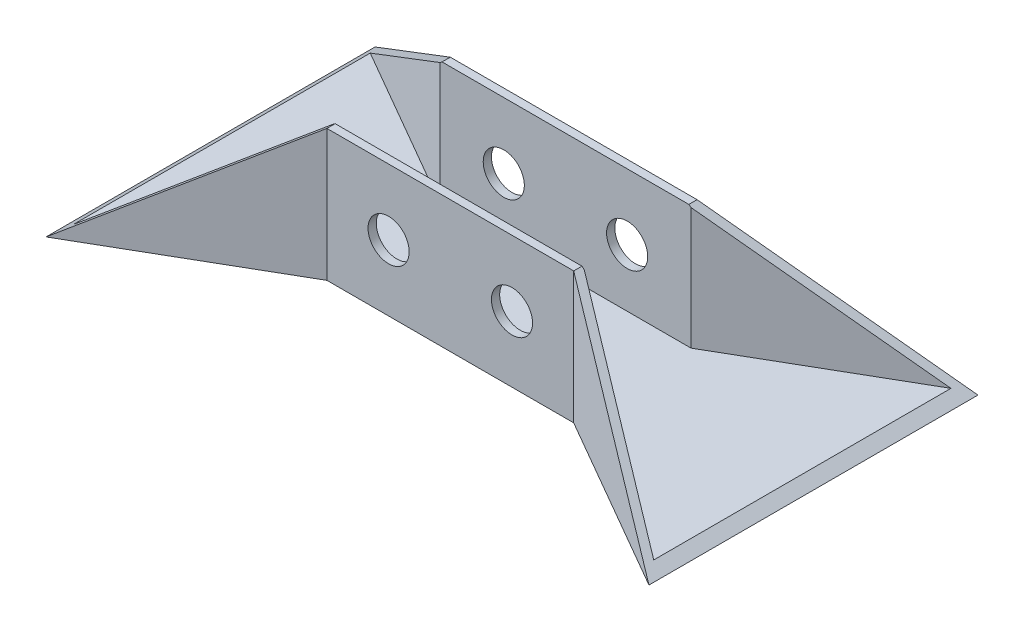
ISO-10303-21;
HEADER;
FILE_DESCRIPTION(('STEP AP214'),'2;1');
FILE_NAME('part.step','',(''),(''),'','','');
FILE_SCHEMA(('AUTOMOTIVE_DESIGN { 1 0 10303 214 1 1 1 1 }'));
ENDSEC;
DATA;
#1=APPLICATION_CONTEXT('core data for automotive mechanical design processes');
#2=APPLICATION_PROTOCOL_DEFINITION('international standard','automotive_design',2000,#1);
#3=PRODUCT_CONTEXT('',#1,'mechanical');
#4=PRODUCT('Part','Part','',(#3));
#5=PRODUCT_RELATED_PRODUCT_CATEGORY('part','',(#4));
#6=PRODUCT_DEFINITION_FORMATION('','',#4);
#7=PRODUCT_DEFINITION_CONTEXT('part definition',#1,'design');
#8=PRODUCT_DEFINITION('design','',#6,#7);
#9=PRODUCT_DEFINITION_SHAPE('','',#8);
#10=(LENGTH_UNIT() NAMED_UNIT(*) SI_UNIT(.MILLI.,.METRE.));
#11=(NAMED_UNIT(*) PLANE_ANGLE_UNIT() SI_UNIT($,.RADIAN.));
#12=(NAMED_UNIT(*) SI_UNIT($,.STERADIAN.) SOLID_ANGLE_UNIT());
#13=UNCERTAINTY_MEASURE_WITH_UNIT(LENGTH_MEASURE(1.E-05),#10,'distance_accuracy_value','');
#14=(GEOMETRIC_REPRESENTATION_CONTEXT(3) GLOBAL_UNCERTAINTY_ASSIGNED_CONTEXT((#13)) GLOBAL_UNIT_ASSIGNED_CONTEXT((#10,
#11,#12)) REPRESENTATION_CONTEXT('',''));
#15=CARTESIAN_POINT('',(0.,0.,0.));
#16=DIRECTION('',(0.,0.,1.));
#17=DIRECTION('',(1.,0.,0.));
#18=AXIS2_PLACEMENT_3D('',#15,#16,#17);
#19=CARTESIAN_POINT('',(0.,5.,0.));
#20=DIRECTION('',(0.,1.,0.));
#21=DIRECTION('',(0.,0.,1.));
#22=AXIS2_PLACEMENT_3D('',#19,#20,#21);
#23=PLANE('',#22);
#24=DIRECTION('',(0.,0.,1.));
#25=VECTOR('',#24,1.);
#26=CARTESIAN_POINT('',(176.487352005989,5.,0.));
#27=LINE('',#26,#25);
#28=CARTESIAN_POINT('',(176.487352005989,5.,-90.3202473081037));
#29=VERTEX_POINT('',#28);
#30=CARTESIAN_POINT('',(176.487352005989,5.,90.3202473081037));
#31=VERTEX_POINT('',#30);
#32=EDGE_CURVE('E218',#29,#31,#27,.T.);
#33=ORIENTED_EDGE('',*,*,#32,.F.);
#34=DIRECTION('',(0.866025403784438,0.,-0.500000000000001));
#35=VECTOR('',#34,1.);
#36=CARTESIAN_POINT('',(76.3397459621556,5.,-32.5));
#37=LINE('',#36,#35);
#38=CARTESIAN_POINT('',(76.3397459621556,5.,-32.5));
#39=VERTEX_POINT('',#38);
#40=EDGE_CURVE('E250',#39,#29,#37,.T.);
#41=ORIENTED_EDGE('',*,*,#40,.F.);
#42=DIRECTION('',(1.,0.,0.));
#43=VECTOR('',#42,1.);
#44=CARTESIAN_POINT('',(-76.3397459621556,5.,-32.5));
#45=LINE('',#44,#43);
#46=CARTESIAN_POINT('',(-76.3397459621556,5.,-32.5));
#47=VERTEX_POINT('',#46);
#48=EDGE_CURVE('E255',#47,#39,#45,.T.);
#49=ORIENTED_EDGE('',*,*,#48,.F.);
#50=DIRECTION('',(0.866025403784438,0.,0.500000000000001));
#51=VECTOR('',#50,1.);
#52=CARTESIAN_POINT('',(-183.253175473055,5.,-94.2264973081037));
#53=LINE('',#52,#51);
#54=CARTESIAN_POINT('',(-176.487352005989,5.,-90.3202473081037));
#55=VERTEX_POINT('',#54);
#56=EDGE_CURVE('E57',#55,#47,#53,.T.);
#57=ORIENTED_EDGE('',*,*,#56,.F.);
#58=DIRECTION('',(0.,0.,-1.));
#59=VECTOR('',#58,1.);
#60=CARTESIAN_POINT('',(-176.487352005989,5.,0.));
#61=LINE('',#60,#59);
#62=CARTESIAN_POINT('',(-176.487352005989,5.,90.3202473081038));
#63=VERTEX_POINT('',#62);
#64=EDGE_CURVE('E232',#63,#55,#61,.T.);
#65=ORIENTED_EDGE('',*,*,#64,.F.);
#66=DIRECTION('',(-0.866025403784438,0.,0.500000000000001));
#67=VECTOR('',#66,1.);
#68=CARTESIAN_POINT('',(-183.253175473055,5.,94.2264973081038));
#69=LINE('',#68,#67);
#70=CARTESIAN_POINT('',(-76.3397459621556,5.,32.5));
#71=VERTEX_POINT('',#70);
#72=EDGE_CURVE('E180',#71,#63,#69,.T.);
#73=ORIENTED_EDGE('',*,*,#72,.F.);
#74=DIRECTION('',(-1.,0.,0.));
#75=VECTOR('',#74,1.);
#76=CARTESIAN_POINT('',(-76.3397459621556,5.,32.5));
#77=LINE('',#76,#75);
#78=CARTESIAN_POINT('',(76.3397459621556,5.,32.5));
#79=VERTEX_POINT('',#78);
#80=EDGE_CURVE('E185',#79,#71,#77,.T.);
#81=ORIENTED_EDGE('',*,*,#80,.F.);
#82=DIRECTION('',(-0.866025403784438,0.,-0.500000000000001));
#83=VECTOR('',#82,1.);
#84=CARTESIAN_POINT('',(76.3397459621556,5.,32.5));
#85=LINE('',#84,#83);
#86=EDGE_CURVE('E184',#31,#79,#85,.T.);
#87=ORIENTED_EDGE('',*,*,#86,.F.);
#88=EDGE_LOOP('',(#33,#41,#49,#57,#65,#73,#81,#87));
#89=FACE_BOUND('',#88,.T.);
#90=ADVANCED_FACE('F32',(#89),#23,.T.);
#91=CARTESIAN_POINT('',(-75.,5.,-37.5));
#92=DIRECTION('',(-0.500000000000001,0.,0.866025403784438));
#93=DIRECTION('',(0.866025403784438,0.,0.500000000000001));
#94=AXIS2_PLACEMENT_3D('',#91,#92,#93);
#95=PLANE('',#94);
#96=DIRECTION('',(-0.866025403784438,0.,-0.500000000000001));
#97=VECTOR('',#96,1.);
#98=CARTESIAN_POINT('',(-75.,0.,-37.5));
#99=LINE('',#98,#97);
#100=CARTESIAN_POINT('',(-75.,0.,-37.5));
#101=VERTEX_POINT('',#100);
#102=CARTESIAN_POINT('',(-183.253175473055,0.,-100.));
#103=VERTEX_POINT('',#102);
#104=EDGE_CURVE('E275',#101,#103,#99,.T.);
#105=ORIENTED_EDGE('',*,*,#104,.T.);
#106=DIRECTION('',(0.729428429853969,0.539053696423368,0.421135700330756));
#107=VECTOR('',#106,1.);
#108=CARTESIAN_POINT('',(-104.490081854181,58.2065834279228,-54.5261066969353));
#109=LINE('',#108,#107);
#110=CARTESIAN_POINT('',(-75.,80.,-37.5));
#111=VERTEX_POINT('',#110);
#112=EDGE_CURVE('E243',#103,#111,#109,.T.);
#113=ORIENTED_EDGE('',*,*,#112,.T.);
#114=DIRECTION('',(0.,-1.,0.));
#115=VECTOR('',#114,1.);
#116=CARTESIAN_POINT('',(-75.,5.,-37.5));
#117=LINE('',#116,#115);
#118=EDGE_CURVE('E168',#111,#101,#117,.T.);
#119=ORIENTED_EDGE('',*,*,#118,.T.);
#120=EDGE_LOOP('',(#105,#113,#119));
#121=FACE_BOUND('',#120,.T.);
#122=ADVANCED_FACE('F34',(#121),#95,.F.);
#123=CARTESIAN_POINT('',(-183.253175473055,5.,100.));
#124=DIRECTION('',(-0.500000000000001,0.,-0.866025403784438));
#125=DIRECTION('',(-0.866025403784438,0.,0.500000000000001));
#126=AXIS2_PLACEMENT_3D('',#123,#124,#125);
#127=PLANE('',#126);
#128=DIRECTION('',(0.,-1.,0.));
#129=VECTOR('',#128,1.);
#130=CARTESIAN_POINT('',(-75.,5.,37.5));
#131=LINE('',#130,#129);
#132=CARTESIAN_POINT('',(-75.,80.,37.5));
#133=VERTEX_POINT('',#132);
#134=CARTESIAN_POINT('',(-75.,0.,37.5));
#135=VERTEX_POINT('',#134);
#136=EDGE_CURVE('E175',#133,#135,#131,.T.);
#137=ORIENTED_EDGE('',*,*,#136,.F.);
#138=DIRECTION('',(-0.729428429853969,-0.539053696423368,0.421135700330756));
#139=VECTOR('',#138,1.);
#140=CARTESIAN_POINT('',(-181.287170016109,1.45289443813848,98.8649262202043));
#141=LINE('',#140,#139);
#142=CARTESIAN_POINT('',(-183.253175473055,0.,100.));
#143=VERTEX_POINT('',#142);
#144=EDGE_CURVE('E240',#133,#143,#141,.T.);
#145=ORIENTED_EDGE('',*,*,#144,.T.);
#146=DIRECTION('',(0.866025403784438,0.,-0.500000000000001));
#147=VECTOR('',#146,1.);
#148=CARTESIAN_POINT('',(-183.253175473055,0.,100.));
#149=LINE('',#148,#147);
#150=EDGE_CURVE('E280',#143,#135,#149,.T.);
#151=ORIENTED_EDGE('',*,*,#150,.T.);
#152=EDGE_LOOP('',(#137,#145,#151));
#153=FACE_BOUND('',#152,.T.);
#154=ADVANCED_FACE('F288',(#153),#127,.F.);
#155=CARTESIAN_POINT('',(-75.,5.,37.5));
#156=DIRECTION('',(0.,0.,-1.));
#157=DIRECTION('',(-1.,0.,0.));
#158=AXIS2_PLACEMENT_3D('',#155,#156,#157);
#159=PLANE('',#158);
#160=CARTESIAN_POINT('',(37.5,40.,37.5));
#161=DIRECTION('',(0.,0.,-1.));
#162=DIRECTION('',(-1.,0.,0.));
#163=AXIS2_PLACEMENT_3D('',#160,#161,#162);
#164=CIRCLE('',#163,12.5);
#165=CARTESIAN_POINT('',(25.,40.,37.5));
#166=VERTEX_POINT('',#165);
#167=EDGE_CURVE('E190',#166,#166,#164,.T.);
#168=ORIENTED_EDGE('',*,*,#167,.T.);
#169=EDGE_LOOP('',(#168));
#170=FACE_BOUND('',#169,.T.);
#171=CARTESIAN_POINT('',(-37.5,40.,37.5));
#172=DIRECTION('',(0.,0.,-1.));
#173=DIRECTION('',(-1.,0.,0.));
#174=AXIS2_PLACEMENT_3D('',#171,#172,#173);
#175=CIRCLE('',#174,12.5);
#176=CARTESIAN_POINT('',(-50.,40.,37.5));
#177=VERTEX_POINT('',#176);
#178=EDGE_CURVE('E208',#177,#177,#175,.T.);
#179=ORIENTED_EDGE('',*,*,#178,.T.);
#180=EDGE_LOOP('',(#179));
#181=FACE_BOUND('',#180,.T.);
#182=DIRECTION('',(1.,0.,0.));
#183=VECTOR('',#182,1.);
#184=CARTESIAN_POINT('',(-75.,0.,37.5));
#185=LINE('',#184,#183);
#186=CARTESIAN_POINT('',(75.,0.,37.5));
#187=VERTEX_POINT('',#186);
#188=EDGE_CURVE('E155',#135,#187,#185,.T.);
#189=ORIENTED_EDGE('',*,*,#188,.T.);
#190=DIRECTION('',(0.,-1.,0.));
#191=VECTOR('',#190,1.);
#192=CARTESIAN_POINT('',(75.,5.,37.5));
#193=LINE('',#192,#191);
#194=CARTESIAN_POINT('',(75.,80.,37.5));
#195=VERTEX_POINT('',#194);
#196=EDGE_CURVE('E152',#195,#187,#193,.T.);
#197=ORIENTED_EDGE('',*,*,#196,.F.);
#198=DIRECTION('',(1.,0.,0.));
#199=VECTOR('',#198,1.);
#200=CARTESIAN_POINT('',(-75.,80.,37.5));
#201=LINE('',#200,#199);
#202=EDGE_CURVE('E262',#133,#195,#201,.T.);
#203=ORIENTED_EDGE('',*,*,#202,.F.);
#204=ORIENTED_EDGE('',*,*,#136,.T.);
#205=EDGE_LOOP('',(#189,#197,#203,#204));
#206=FACE_BOUND('',#205,.T.);
#207=ADVANCED_FACE('F282',(#170,#181,#206),#159,.F.);
#208=CARTESIAN_POINT('',(75.,5.,37.5));
#209=DIRECTION('',(0.500000000000001,0.,-0.866025403784438));
#210=DIRECTION('',(-0.866025403784438,0.,-0.500000000000001));
#211=AXIS2_PLACEMENT_3D('',#208,#209,#210);
#212=PLANE('',#211);
#213=DIRECTION('',(0.866025403784438,0.,0.500000000000001));
#214=VECTOR('',#213,1.);
#215=CARTESIAN_POINT('',(75.,0.,37.5));
#216=LINE('',#215,#214);
#217=CARTESIAN_POINT('',(183.253175473055,0.,100.));
#218=VERTEX_POINT('',#217);
#219=EDGE_CURVE('E150',#187,#218,#216,.T.);
#220=ORIENTED_EDGE('',*,*,#219,.T.);
#221=DIRECTION('',(-0.729428429853969,0.539053696423368,-0.421135700330756));
#222=VECTOR('',#221,1.);
#223=CARTESIAN_POINT('',(104.490081854181,58.2065834279228,54.5261066969353));
#224=LINE('',#223,#222);
#225=EDGE_CURVE('E135',#218,#195,#224,.T.);
#226=ORIENTED_EDGE('',*,*,#225,.T.);
#227=ORIENTED_EDGE('',*,*,#196,.T.);
#228=EDGE_LOOP('',(#220,#226,#227));
#229=FACE_BOUND('',#228,.T.);
#230=ADVANCED_FACE('F151',(#229),#212,.F.);
#231=CARTESIAN_POINT('',(183.253175473055,5.,-100.));
#232=DIRECTION('',(0.500000000000001,0.,0.866025403784438));
#233=DIRECTION('',(0.866025403784438,0.,-0.500000000000001));
#234=AXIS2_PLACEMENT_3D('',#231,#232,#233);
#235=PLANE('',#234);
#236=DIRECTION('',(0.,-1.,0.));
#237=VECTOR('',#236,1.);
#238=CARTESIAN_POINT('',(75.,5.,-37.5));
#239=LINE('',#238,#237);
#240=CARTESIAN_POINT('',(75.,80.,-37.5));
#241=VERTEX_POINT('',#240);
#242=CARTESIAN_POINT('',(75.,0.,-37.5));
#243=VERTEX_POINT('',#242);
#244=EDGE_CURVE('E171',#241,#243,#239,.T.);
#245=ORIENTED_EDGE('',*,*,#244,.F.);
#246=DIRECTION('',(0.729428429853969,-0.539053696423368,-0.421135700330756));
#247=VECTOR('',#246,1.);
#248=CARTESIAN_POINT('',(181.287170016109,1.45289443813848,-98.8649262202043));
#249=LINE('',#248,#247);
#250=CARTESIAN_POINT('',(183.253175473055,0.,-100.));
#251=VERTEX_POINT('',#250);
#252=EDGE_CURVE('E147',#241,#251,#249,.T.);
#253=ORIENTED_EDGE('',*,*,#252,.T.);
#254=DIRECTION('',(-0.866025403784438,0.,0.500000000000001));
#255=VECTOR('',#254,1.);
#256=CARTESIAN_POINT('',(183.253175473055,0.,-100.));
#257=LINE('',#256,#255);
#258=EDGE_CURVE('E161',#251,#243,#257,.T.);
#259=ORIENTED_EDGE('',*,*,#258,.T.);
#260=EDGE_LOOP('',(#245,#253,#259));
#261=FACE_BOUND('',#260,.T.);
#262=ADVANCED_FACE('F341',(#261),#235,.F.);
#263=CARTESIAN_POINT('',(75.,5.,-37.5));
#264=DIRECTION('',(0.,0.,1.));
#265=DIRECTION('',(1.,0.,0.));
#266=AXIS2_PLACEMENT_3D('',#263,#264,#265);
#267=PLANE('',#266);
#268=CARTESIAN_POINT('',(37.5,40.,-37.5));
#269=DIRECTION('',(0.,0.,1.));
#270=DIRECTION('',(1.,0.,0.));
#271=AXIS2_PLACEMENT_3D('',#268,#269,#270);
#272=CIRCLE('',#271,12.5);
#273=CARTESIAN_POINT('',(50.,40.,-37.5));
#274=VERTEX_POINT('',#273);
#275=EDGE_CURVE('E197',#274,#274,#272,.T.);
#276=ORIENTED_EDGE('',*,*,#275,.T.);
#277=EDGE_LOOP('',(#276));
#278=FACE_BOUND('',#277,.T.);
#279=CARTESIAN_POINT('',(-37.5,40.,-37.5));
#280=DIRECTION('',(0.,0.,1.));
#281=DIRECTION('',(1.,0.,0.));
#282=AXIS2_PLACEMENT_3D('',#279,#280,#281);
#283=CIRCLE('',#282,12.5);
#284=CARTESIAN_POINT('',(-25.,40.,-37.5));
#285=VERTEX_POINT('',#284);
#286=EDGE_CURVE('E194',#285,#285,#283,.T.);
#287=ORIENTED_EDGE('',*,*,#286,.T.);
#288=EDGE_LOOP('',(#287));
#289=FACE_BOUND('',#288,.T.);
#290=DIRECTION('',(-1.,0.,0.));
#291=VECTOR('',#290,1.);
#292=CARTESIAN_POINT('',(75.,0.,-37.5));
#293=LINE('',#292,#291);
#294=EDGE_CURVE('E163',#243,#101,#293,.T.);
#295=ORIENTED_EDGE('',*,*,#294,.T.);
#296=ORIENTED_EDGE('',*,*,#118,.F.);
#297=DIRECTION('',(-1.,0.,0.));
#298=VECTOR('',#297,1.);
#299=CARTESIAN_POINT('',(-75.,80.,-37.5));
#300=LINE('',#299,#298);
#301=EDGE_CURVE('E249',#241,#111,#300,.T.);
#302=ORIENTED_EDGE('',*,*,#301,.F.);
#303=ORIENTED_EDGE('',*,*,#244,.T.);
#304=EDGE_LOOP('',(#295,#296,#302,#303));
#305=FACE_BOUND('',#304,.T.);
#306=ADVANCED_FACE('F338',(#278,#289,#305),#267,.F.);
#307=CARTESIAN_POINT('',(0.,0.,0.));
#308=DIRECTION('',(0.,1.,0.));
#309=DIRECTION('',(0.,0.,1.));
#310=AXIS2_PLACEMENT_3D('',#307,#308,#309);
#311=PLANE('',#310);
#312=ORIENTED_EDGE('',*,*,#104,.F.);
#313=ORIENTED_EDGE('',*,*,#294,.F.);
#314=ORIENTED_EDGE('',*,*,#258,.F.);
#315=DIRECTION('',(0.,0.,-1.));
#316=VECTOR('',#315,1.);
#317=CARTESIAN_POINT('',(183.253175473055,0.,100.));
#318=LINE('',#317,#316);
#319=EDGE_CURVE('E139',#218,#251,#318,.T.);
#320=ORIENTED_EDGE('',*,*,#319,.F.);
#321=ORIENTED_EDGE('',*,*,#219,.F.);
#322=ORIENTED_EDGE('',*,*,#188,.F.);
#323=ORIENTED_EDGE('',*,*,#150,.F.);
#324=DIRECTION('',(0.,0.,1.));
#325=VECTOR('',#324,1.);
#326=CARTESIAN_POINT('',(-183.253175473055,0.,-100.));
#327=LINE('',#326,#325);
#328=EDGE_CURVE('E278',#103,#143,#327,.T.);
#329=ORIENTED_EDGE('',*,*,#328,.F.);
#330=EDGE_LOOP('',(#312,#313,#314,#320,#321,#322,#323,#329));
#331=FACE_BOUND('',#330,.T.);
#332=ADVANCED_FACE('F159',(#331),#311,.F.);
#333=CARTESIAN_POINT('',(76.3397459621556,80.,32.5));
#334=DIRECTION('',(-0.500000000000001,0.,0.866025403784438));
#335=DIRECTION('',(0.866025403784438,0.,0.500000000000001));
#336=AXIS2_PLACEMENT_3D('',#333,#334,#335);
#337=PLANE('',#336);
#338=DIRECTION('',(0.,-1.,0.));
#339=VECTOR('',#338,1.);
#340=CARTESIAN_POINT('',(76.3397459621556,80.,32.5));
#341=LINE('',#340,#339);
#342=CARTESIAN_POINT('',(76.3397459621556,79.0099165543728,32.5));
#343=VERTEX_POINT('',#342);
#344=EDGE_CURVE('E272',#343,#79,#341,.T.);
#345=ORIENTED_EDGE('',*,*,#344,.F.);
#346=DIRECTION('',(0.729428429853969,-0.539053696423368,0.421135700330756));
#347=VECTOR('',#346,1.);
#348=CARTESIAN_POINT('',(75.9504440707687,79.2976139006617,32.2752364482117));
#349=LINE('',#348,#347);
#350=EDGE_CURVE('E220',#343,#31,#349,.T.);
#351=ORIENTED_EDGE('',*,*,#350,.T.);
#352=ORIENTED_EDGE('',*,*,#86,.T.);
#353=EDGE_LOOP('',(#345,#351,#352));
#354=FACE_BOUND('',#353,.T.);
#355=ADVANCED_FACE('F308',(#354),#337,.F.);
#356=CARTESIAN_POINT('',(-76.3397459621556,80.,32.5));
#357=DIRECTION('',(0.,0.,1.));
#358=DIRECTION('',(1.,0.,0.));
#359=AXIS2_PLACEMENT_3D('',#356,#357,#358);
#360=PLANE('',#359);
#361=CARTESIAN_POINT('',(37.5,40.,32.5));
#362=DIRECTION('',(0.,0.,1.));
#363=DIRECTION('',(1.,0.,0.));
#364=AXIS2_PLACEMENT_3D('',#361,#362,#363);
#365=CIRCLE('',#364,12.5);
#366=CARTESIAN_POINT('',(50.,40.,32.5));
#367=VERTEX_POINT('',#366);
#368=EDGE_CURVE('E202',#367,#367,#365,.T.);
#369=ORIENTED_EDGE('',*,*,#368,.T.);
#370=EDGE_LOOP('',(#369));
#371=FACE_BOUND('',#370,.T.);
#372=CARTESIAN_POINT('',(-37.5,40.,32.5));
#373=DIRECTION('',(0.,0.,1.));
#374=DIRECTION('',(1.,0.,0.));
#375=AXIS2_PLACEMENT_3D('',#372,#373,#374);
#376=CIRCLE('',#375,12.5);
#377=CARTESIAN_POINT('',(-25.,40.,32.5));
#378=VERTEX_POINT('',#377);
#379=EDGE_CURVE('E189',#378,#378,#376,.T.);
#380=ORIENTED_EDGE('',*,*,#379,.T.);
#381=EDGE_LOOP('',(#380));
#382=FACE_BOUND('',#381,.T.);
#383=DIRECTION('',(-1.,0.,0.));
#384=VECTOR('',#383,1.);
#385=CARTESIAN_POINT('',(-76.3397459621556,80.,32.5));
#386=LINE('',#385,#384);
#387=CARTESIAN_POINT('',(75.,80.,32.5));
#388=VERTEX_POINT('',#387);
#389=CARTESIAN_POINT('',(-75.,80.,32.5));
#390=VERTEX_POINT('',#389);
#391=EDGE_CURVE('E265',#388,#390,#386,.T.);
#392=ORIENTED_EDGE('',*,*,#391,.F.);
#393=DIRECTION('',(0.804223072234167,-0.594327561270919,0.));
#394=VECTOR('',#393,1.);
#395=CARTESIAN_POINT('',(-22.8827263466855,152.33615155875,32.5));
#396=LINE('',#395,#394);
#397=EDGE_CURVE('E223',#388,#343,#396,.T.);
#398=ORIENTED_EDGE('',*,*,#397,.T.);
#399=ORIENTED_EDGE('',*,*,#344,.T.);
#400=ORIENTED_EDGE('',*,*,#80,.T.);
#401=DIRECTION('',(0.,-1.,0.));
#402=VECTOR('',#401,1.);
#403=CARTESIAN_POINT('',(-76.3397459621556,80.,32.5));
#404=LINE('',#403,#402);
#405=CARTESIAN_POINT('',(-76.3397459621556,79.0099165543728,32.5));
#406=VERTEX_POINT('',#405);
#407=EDGE_CURVE('E267',#406,#71,#404,.T.);
#408=ORIENTED_EDGE('',*,*,#407,.F.);
#409=DIRECTION('',(0.804223072234167,0.594327561270919,0.));
#410=VECTOR('',#409,1.);
#411=CARTESIAN_POINT('',(-75.8665138596212,79.3596390270607,32.5));
#412=LINE('',#411,#410);
#413=EDGE_CURVE('E237',#406,#390,#412,.T.);
#414=ORIENTED_EDGE('',*,*,#413,.T.);
#415=EDGE_LOOP('',(#392,#398,#399,#400,#408,#414));
#416=FACE_BOUND('',#415,.T.);
#417=ADVANCED_FACE('F295',(#371,#382,#416),#360,.F.);
#418=CARTESIAN_POINT('',(-183.253175473055,80.,94.2264973081038));
#419=DIRECTION('',(0.500000000000001,0.,0.866025403784438));
#420=DIRECTION('',(0.866025403784438,0.,-0.500000000000001));
#421=AXIS2_PLACEMENT_3D('',#418,#419,#420);
#422=PLANE('',#421);
#423=ORIENTED_EDGE('',*,*,#72,.T.);
#424=DIRECTION('',(0.729428429853969,0.539053696423368,-0.421135700330756));
#425=VECTOR('',#424,1.);
#426=CARTESIAN_POINT('',(-151.797088161929,23.2463110102157,76.0653168313727));
#427=LINE('',#426,#425);
#428=EDGE_CURVE('E234',#63,#406,#427,.T.);
#429=ORIENTED_EDGE('',*,*,#428,.T.);
#430=ORIENTED_EDGE('',*,*,#407,.T.);
#431=EDGE_LOOP('',(#423,#429,#430));
#432=FACE_BOUND('',#431,.T.);
#433=ADVANCED_FACE('F301',(#432),#422,.F.);
#434=CARTESIAN_POINT('',(0.,80.,0.));
#435=DIRECTION('',(0.,-1.,0.));
#436=DIRECTION('',(0.,0.,-1.));
#437=AXIS2_PLACEMENT_3D('',#434,#435,#436);
#438=PLANE('',#437);
#439=ORIENTED_EDGE('',*,*,#202,.T.);
#440=DIRECTION('',(0.,0.,1.));
#441=VECTOR('',#440,1.);
#442=CARTESIAN_POINT('',(75.,80.,-100.));
#443=LINE('',#442,#441);
#444=EDGE_CURVE('E142',#388,#195,#443,.T.);
#445=ORIENTED_EDGE('',*,*,#444,.F.);
#446=ORIENTED_EDGE('',*,*,#391,.T.);
#447=DIRECTION('',(0.,0.,1.));
#448=VECTOR('',#447,1.);
#449=CARTESIAN_POINT('',(-75.,80.,-100.));
#450=LINE('',#449,#448);
#451=EDGE_CURVE('E146',#390,#133,#450,.T.);
#452=ORIENTED_EDGE('',*,*,#451,.T.);
#453=EDGE_LOOP('',(#439,#445,#446,#452));
#454=FACE_BOUND('',#453,.T.);
#455=ADVANCED_FACE('F292',(#454),#438,.F.);
#456=CARTESIAN_POINT('',(-183.253175473055,80.,-94.2264973081037));
#457=DIRECTION('',(0.500000000000001,0.,-0.866025403784438));
#458=DIRECTION('',(-0.866025403784438,0.,-0.500000000000001));
#459=AXIS2_PLACEMENT_3D('',#456,#457,#458);
#460=PLANE('',#459);
#461=DIRECTION('',(0.,-1.,0.));
#462=VECTOR('',#461,1.);
#463=CARTESIAN_POINT('',(-76.3397459621556,80.,-32.5));
#464=LINE('',#463,#462);
#465=CARTESIAN_POINT('',(-76.3397459621556,79.0099165543728,-32.5));
#466=VERTEX_POINT('',#465);
#467=EDGE_CURVE('E186',#466,#47,#464,.T.);
#468=ORIENTED_EDGE('',*,*,#467,.F.);
#469=DIRECTION('',(-0.729428429853969,-0.539053696423368,-0.421135700330756));
#470=VECTOR('',#469,1.);
#471=CARTESIAN_POINT('',(-151.797088161929,23.2463110102157,-76.0653168313727));
#472=LINE('',#471,#470);
#473=EDGE_CURVE('E230',#466,#55,#472,.T.);
#474=ORIENTED_EDGE('',*,*,#473,.T.);
#475=ORIENTED_EDGE('',*,*,#56,.T.);
#476=EDGE_LOOP('',(#468,#474,#475));
#477=FACE_BOUND('',#476,.T.);
#478=ADVANCED_FACE('F317',(#477),#460,.F.);
#479=CARTESIAN_POINT('',(-76.3397459621556,80.,-32.5));
#480=DIRECTION('',(0.,0.,-1.));
#481=DIRECTION('',(-1.,0.,0.));
#482=AXIS2_PLACEMENT_3D('',#479,#480,#481);
#483=PLANE('',#482);
#484=CARTESIAN_POINT('',(37.5,40.,-32.5));
#485=DIRECTION('',(0.,0.,-1.));
#486=DIRECTION('',(-1.,0.,0.));
#487=AXIS2_PLACEMENT_3D('',#484,#485,#486);
#488=CIRCLE('',#487,12.5);
#489=CARTESIAN_POINT('',(25.,40.,-32.5));
#490=VERTEX_POINT('',#489);
#491=EDGE_CURVE('E36',#490,#490,#488,.T.);
#492=ORIENTED_EDGE('',*,*,#491,.T.);
#493=EDGE_LOOP('',(#492));
#494=FACE_BOUND('',#493,.T.);
#495=CARTESIAN_POINT('',(-37.5,40.,-32.5));
#496=DIRECTION('',(0.,0.,-1.));
#497=DIRECTION('',(-1.,0.,0.));
#498=AXIS2_PLACEMENT_3D('',#495,#496,#497);
#499=CIRCLE('',#498,12.5);
#500=CARTESIAN_POINT('',(-50.,40.,-32.5));
#501=VERTEX_POINT('',#500);
#502=EDGE_CURVE('E187',#501,#501,#499,.T.);
#503=ORIENTED_EDGE('',*,*,#502,.T.);
#504=EDGE_LOOP('',(#503));
#505=FACE_BOUND('',#504,.T.);
#506=DIRECTION('',(0.,-1.,0.));
#507=VECTOR('',#506,1.);
#508=CARTESIAN_POINT('',(76.3397459621556,80.,-32.5));
#509=LINE('',#508,#507);
#510=CARTESIAN_POINT('',(76.3397459621556,79.0099165543728,-32.5));
#511=VERTEX_POINT('',#510);
#512=EDGE_CURVE('E253',#511,#39,#509,.T.);
#513=ORIENTED_EDGE('',*,*,#512,.F.);
#514=DIRECTION('',(-0.804223072234167,0.594327561270919,0.));
#515=VECTOR('',#514,1.);
#516=CARTESIAN_POINT('',(-22.8827263466855,152.33615155875,-32.5));
#517=LINE('',#516,#515);
#518=CARTESIAN_POINT('',(75.,80.,-32.5));
#519=VERTEX_POINT('',#518);
#520=EDGE_CURVE('E215',#511,#519,#517,.T.);
#521=ORIENTED_EDGE('',*,*,#520,.T.);
#522=DIRECTION('',(1.,0.,0.));
#523=VECTOR('',#522,1.);
#524=CARTESIAN_POINT('',(-76.3397459621556,80.,-32.5));
#525=LINE('',#524,#523);
#526=CARTESIAN_POINT('',(-75.,80.,-32.5));
#527=VERTEX_POINT('',#526);
#528=EDGE_CURVE('E246',#527,#519,#525,.T.);
#529=ORIENTED_EDGE('',*,*,#528,.F.);
#530=DIRECTION('',(-0.804223072234167,-0.594327561270919,0.));
#531=VECTOR('',#530,1.);
#532=CARTESIAN_POINT('',(-75.8665138596212,79.3596390270607,-32.5));
#533=LINE('',#532,#531);
#534=EDGE_CURVE('E49',#527,#466,#533,.T.);
#535=ORIENTED_EDGE('',*,*,#534,.T.);
#536=ORIENTED_EDGE('',*,*,#467,.T.);
#537=ORIENTED_EDGE('',*,*,#48,.T.);
#538=EDGE_LOOP('',(#513,#521,#529,#535,#536,#537));
#539=FACE_BOUND('',#538,.T.);
#540=ADVANCED_FACE('F315',(#494,#505,#539),#483,.F.);
#541=CARTESIAN_POINT('',(76.3397459621556,80.,-32.5));
#542=DIRECTION('',(-0.500000000000001,0.,-0.866025403784438));
#543=DIRECTION('',(-0.866025403784438,0.,0.500000000000001));
#544=AXIS2_PLACEMENT_3D('',#541,#542,#543);
#545=PLANE('',#544);
#546=ORIENTED_EDGE('',*,*,#40,.T.);
#547=DIRECTION('',(-0.729428429853969,0.539053696423368,0.421135700330756));
#548=VECTOR('',#547,1.);
#549=CARTESIAN_POINT('',(75.9504440707687,79.2976139006617,-32.2752364482117));
#550=LINE('',#549,#548);
#551=EDGE_CURVE('E212',#29,#511,#550,.T.);
#552=ORIENTED_EDGE('',*,*,#551,.T.);
#553=ORIENTED_EDGE('',*,*,#512,.T.);
#554=EDGE_LOOP('',(#546,#552,#553));
#555=FACE_BOUND('',#554,.T.);
#556=ADVANCED_FACE('F312',(#555),#545,.F.);
#557=CARTESIAN_POINT('',(0.,80.,0.));
#558=DIRECTION('',(0.,1.,0.));
#559=DIRECTION('',(0.,0.,1.));
#560=AXIS2_PLACEMENT_3D('',#557,#558,#559);
#561=PLANE('',#560);
#562=DIRECTION('',(0.,0.,1.));
#563=VECTOR('',#562,1.);
#564=CARTESIAN_POINT('',(75.,80.,0.));
#565=LINE('',#564,#563);
#566=EDGE_CURVE('E11',#241,#519,#565,.T.);
#567=ORIENTED_EDGE('',*,*,#566,.F.);
#568=ORIENTED_EDGE('',*,*,#301,.T.);
#569=DIRECTION('',(0.,0.,-1.));
#570=VECTOR('',#569,1.);
#571=CARTESIAN_POINT('',(-75.,80.,0.));
#572=LINE('',#571,#570);
#573=EDGE_CURVE('E41',#527,#111,#572,.T.);
#574=ORIENTED_EDGE('',*,*,#573,.F.);
#575=ORIENTED_EDGE('',*,*,#528,.T.);
#576=EDGE_LOOP('',(#567,#568,#574,#575));
#577=FACE_BOUND('',#576,.T.);
#578=ADVANCED_FACE('F411',(#577),#561,.T.);
#579=CARTESIAN_POINT('',(-183.253175473055,0.,-100.));
#580=DIRECTION('',(0.594327561270919,-0.804223072234167,0.));
#581=DIRECTION('',(0.804223072234167,0.594327561270919,0.));
#582=AXIS2_PLACEMENT_3D('',#579,#580,#581);
#583=PLANE('',#582);
#584=ORIENTED_EDGE('',*,*,#328,.T.);
#585=ORIENTED_EDGE('',*,*,#144,.F.);
#586=ORIENTED_EDGE('',*,*,#451,.F.);
#587=ORIENTED_EDGE('',*,*,#413,.F.);
#588=ORIENTED_EDGE('',*,*,#428,.F.);
#589=ORIENTED_EDGE('',*,*,#64,.T.);
#590=ORIENTED_EDGE('',*,*,#473,.F.);
#591=ORIENTED_EDGE('',*,*,#534,.F.);
#592=ORIENTED_EDGE('',*,*,#573,.T.);
#593=ORIENTED_EDGE('',*,*,#112,.F.);
#594=EDGE_LOOP('',(#584,#585,#586,#587,#588,#589,#590,#591,#592,#593));
#595=FACE_BOUND('',#594,.T.);
#596=ADVANCED_FACE('F290',(#595),#583,.F.);
#597=CARTESIAN_POINT('',(183.253175473055,0.,-100.));
#598=DIRECTION('',(-0.594327561270919,-0.804223072234167,0.));
#599=DIRECTION('',(0.804223072234167,-0.594327561270919,0.));
#600=AXIS2_PLACEMENT_3D('',#597,#598,#599);
#601=PLANE('',#600);
#602=ORIENTED_EDGE('',*,*,#319,.T.);
#603=ORIENTED_EDGE('',*,*,#252,.F.);
#604=ORIENTED_EDGE('',*,*,#566,.T.);
#605=ORIENTED_EDGE('',*,*,#520,.F.);
#606=ORIENTED_EDGE('',*,*,#551,.F.);
#607=ORIENTED_EDGE('',*,*,#32,.T.);
#608=ORIENTED_EDGE('',*,*,#350,.F.);
#609=ORIENTED_EDGE('',*,*,#397,.F.);
#610=ORIENTED_EDGE('',*,*,#444,.T.);
#611=ORIENTED_EDGE('',*,*,#225,.F.);
#612=EDGE_LOOP('',(#602,#603,#604,#605,#606,#607,#608,#609,#610,#611));
#613=FACE_BOUND('',#612,.T.);
#614=ADVANCED_FACE('F137',(#613),#601,.F.);
#615=CARTESIAN_POINT('',(-37.5,40.,-100.));
#616=DIRECTION('',(0.,0.,1.));
#617=DIRECTION('',(1.,0.,0.));
#618=AXIS2_PLACEMENT_3D('',#615,#616,#617);
#619=CYLINDRICAL_SURFACE('',#618,12.5);
#620=ORIENTED_EDGE('',*,*,#502,.F.);
#621=EDGE_LOOP('',(#620));
#622=FACE_BOUND('',#621,.T.);
#623=ORIENTED_EDGE('',*,*,#286,.F.);
#624=EDGE_LOOP('',(#623));
#625=FACE_BOUND('',#624,.T.);
#626=ADVANCED_FACE('F435',(#622,#625),#619,.F.);
#627=ORIENTED_EDGE('',*,*,#379,.F.);
#628=EDGE_LOOP('',(#627));
#629=FACE_BOUND('',#628,.T.);
#630=ORIENTED_EDGE('',*,*,#178,.F.);
#631=EDGE_LOOP('',(#630));
#632=FACE_BOUND('',#631,.T.);
#633=ADVANCED_FACE('F445',(#629,#632),#619,.F.);
#634=CARTESIAN_POINT('',(37.5,40.,-100.));
#635=DIRECTION('',(0.,0.,1.));
#636=DIRECTION('',(1.,0.,0.));
#637=AXIS2_PLACEMENT_3D('',#634,#635,#636);
#638=CYLINDRICAL_SURFACE('',#637,12.5);
#639=ORIENTED_EDGE('',*,*,#491,.F.);
#640=EDGE_LOOP('',(#639));
#641=FACE_BOUND('',#640,.T.);
#642=ORIENTED_EDGE('',*,*,#275,.F.);
#643=EDGE_LOOP('',(#642));
#644=FACE_BOUND('',#643,.T.);
#645=ADVANCED_FACE('F452',(#641,#644),#638,.F.);
#646=ORIENTED_EDGE('',*,*,#368,.F.);
#647=EDGE_LOOP('',(#646));
#648=FACE_BOUND('',#647,.T.);
#649=ORIENTED_EDGE('',*,*,#167,.F.);
#650=EDGE_LOOP('',(#649));
#651=FACE_BOUND('',#650,.T.);
#652=ADVANCED_FACE('F459',(#648,#651),#638,.F.);
#653=CLOSED_SHELL('',(#90,#122,#154,#207,#230,#262,#306,#332,#355,#417,#433,#455,#478,#540,#556,
#578,#596,#614,#626,#633,#645,#652));
#654=MANIFOLD_SOLID_BREP('B2',#653);
#655=ADVANCED_BREP_SHAPE_REPRESENTATION('',(#18,#654),#14);
#656=SHAPE_DEFINITION_REPRESENTATION(#9,#655);
ENDSEC;
END-ISO-10303-21;
